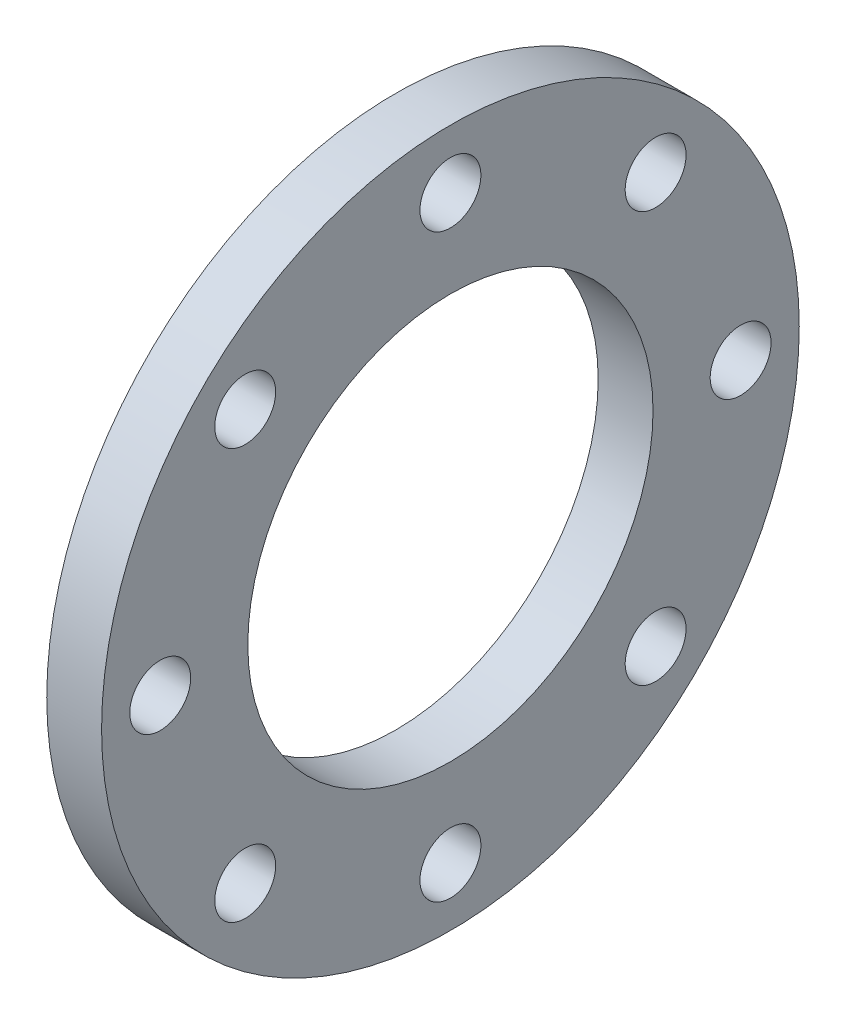
ISO-10303-21;
HEADER;
FILE_DESCRIPTION(('STEP AP214'),'2;1');
FILE_NAME('part.step','',(''),(''),'','','');
FILE_SCHEMA(('AUTOMOTIVE_DESIGN { 1 0 10303 214 1 1 1 1 }'));
ENDSEC;
DATA;
#1=APPLICATION_CONTEXT('core data for automotive mechanical design processes');
#2=APPLICATION_PROTOCOL_DEFINITION('international standard','automotive_design',2000,#1);
#3=PRODUCT_CONTEXT('',#1,'mechanical');
#4=PRODUCT('Part','Part','',(#3));
#5=PRODUCT_RELATED_PRODUCT_CATEGORY('part','',(#4));
#6=PRODUCT_DEFINITION_FORMATION('','',#4);
#7=PRODUCT_DEFINITION_CONTEXT('part definition',#1,'design');
#8=PRODUCT_DEFINITION('design','',#6,#7);
#9=PRODUCT_DEFINITION_SHAPE('','',#8);
#10=(LENGTH_UNIT() NAMED_UNIT(*) SI_UNIT(.MILLI.,.METRE.));
#11=(NAMED_UNIT(*) PLANE_ANGLE_UNIT() SI_UNIT($,.RADIAN.));
#12=(NAMED_UNIT(*) SI_UNIT($,.STERADIAN.) SOLID_ANGLE_UNIT());
#13=UNCERTAINTY_MEASURE_WITH_UNIT(LENGTH_MEASURE(1.E-05),#10,'distance_accuracy_value','');
#14=(GEOMETRIC_REPRESENTATION_CONTEXT(3) GLOBAL_UNCERTAINTY_ASSIGNED_CONTEXT((#13)) GLOBAL_UNIT_ASSIGNED_CONTEXT((#10,
#11,#12)) REPRESENTATION_CONTEXT('',''));
#15=CARTESIAN_POINT('',(0.,0.,0.));
#16=DIRECTION('',(0.,0.,1.));
#17=DIRECTION('',(1.,0.,0.));
#18=AXIS2_PLACEMENT_3D('',#15,#16,#17);
#19=CARTESIAN_POINT('',(18.,67.3519209080187,67.3519209080187));
#20=DIRECTION('',(-1.,0.,0.));
#21=DIRECTION('',(0.,0.,1.));
#22=AXIS2_PLACEMENT_3D('',#19,#20,#21);
#23=CYLINDRICAL_SURFACE('',#22,9.99999999999999);
#24=CARTESIAN_POINT('',(18.,67.3519209080187,67.3519209080187));
#25=DIRECTION('',(-1.,0.,0.));
#26=DIRECTION('',(0.,0.,1.));
#27=AXIS2_PLACEMENT_3D('',#24,#25,#26);
#28=CIRCLE('',#27,9.99999999999999);
#29=CARTESIAN_POINT('',(18.,67.3519209080187,77.3519209080187));
#30=VERTEX_POINT('',#29);
#31=EDGE_CURVE('E51',#30,#30,#28,.T.);
#32=ORIENTED_EDGE('',*,*,#31,.F.);
#33=EDGE_LOOP('',(#32));
#34=FACE_BOUND('',#33,.T.);
#35=CARTESIAN_POINT('',(0.,67.3519209080187,67.3519209080187));
#36=DIRECTION('',(-1.,0.,0.));
#37=DIRECTION('',(0.,0.,1.));
#38=AXIS2_PLACEMENT_3D('',#35,#36,#37);
#39=CIRCLE('',#38,9.99999999999999);
#40=CARTESIAN_POINT('',(0.,67.3519209080187,77.3519209080187));
#41=VERTEX_POINT('',#40);
#42=EDGE_CURVE('E16',#41,#41,#39,.F.);
#43=ORIENTED_EDGE('',*,*,#42,.F.);
#44=EDGE_LOOP('',(#43));
#45=FACE_BOUND('',#44,.T.);
#46=ADVANCED_FACE('F13',(#34,#45),#23,.F.);
#47=CARTESIAN_POINT('',(18.,0.,95.25));
#48=DIRECTION('',(-1.,0.,0.));
#49=DIRECTION('',(0.,0.,1.));
#50=AXIS2_PLACEMENT_3D('',#47,#48,#49);
#51=CYLINDRICAL_SURFACE('',#50,10.);
#52=CARTESIAN_POINT('',(18.,0.,95.25));
#53=DIRECTION('',(-1.,0.,0.));
#54=DIRECTION('',(0.,0.,1.));
#55=AXIS2_PLACEMENT_3D('',#52,#53,#54);
#56=CIRCLE('',#55,10.);
#57=CARTESIAN_POINT('',(18.,0.,105.25));
#58=VERTEX_POINT('',#57);
#59=EDGE_CURVE('E48',#58,#58,#56,.T.);
#60=ORIENTED_EDGE('',*,*,#59,.F.);
#61=EDGE_LOOP('',(#60));
#62=FACE_BOUND('',#61,.T.);
#63=CARTESIAN_POINT('',(0.,0.,95.25));
#64=DIRECTION('',(-1.,0.,0.));
#65=DIRECTION('',(0.,0.,1.));
#66=AXIS2_PLACEMENT_3D('',#63,#64,#65);
#67=CIRCLE('',#66,10.);
#68=CARTESIAN_POINT('',(0.,0.,105.25));
#69=VERTEX_POINT('',#68);
#70=EDGE_CURVE('E74',#69,#69,#67,.F.);
#71=ORIENTED_EDGE('',*,*,#70,.F.);
#72=EDGE_LOOP('',(#71));
#73=FACE_BOUND('',#72,.T.);
#74=ADVANCED_FACE('F85',(#62,#73),#51,.F.);
#75=CARTESIAN_POINT('',(18.,-67.3519209080186,67.3519209080187));
#76=DIRECTION('',(-1.,0.,0.));
#77=DIRECTION('',(0.,0.,1.));
#78=AXIS2_PLACEMENT_3D('',#75,#76,#77);
#79=CYLINDRICAL_SURFACE('',#78,10.);
#80=CARTESIAN_POINT('',(18.,-67.3519209080186,67.3519209080187));
#81=DIRECTION('',(-1.,0.,0.));
#82=DIRECTION('',(0.,0.,1.));
#83=AXIS2_PLACEMENT_3D('',#80,#81,#82);
#84=CIRCLE('',#83,10.);
#85=CARTESIAN_POINT('',(18.,-67.3519209080186,77.3519209080187));
#86=VERTEX_POINT('',#85);
#87=EDGE_CURVE('E45',#86,#86,#84,.T.);
#88=ORIENTED_EDGE('',*,*,#87,.F.);
#89=EDGE_LOOP('',(#88));
#90=FACE_BOUND('',#89,.T.);
#91=CARTESIAN_POINT('',(0.,-67.3519209080186,67.3519209080187));
#92=DIRECTION('',(-1.,0.,0.));
#93=DIRECTION('',(0.,0.,1.));
#94=AXIS2_PLACEMENT_3D('',#91,#92,#93);
#95=CIRCLE('',#94,10.);
#96=CARTESIAN_POINT('',(0.,-67.3519209080186,77.3519209080187));
#97=VERTEX_POINT('',#96);
#98=EDGE_CURVE('E72',#97,#97,#95,.F.);
#99=ORIENTED_EDGE('',*,*,#98,.F.);
#100=EDGE_LOOP('',(#99));
#101=FACE_BOUND('',#100,.T.);
#102=ADVANCED_FACE('F91',(#90,#101),#79,.F.);
#103=CARTESIAN_POINT('',(18.,-95.25,0.));
#104=DIRECTION('',(-1.,0.,0.));
#105=DIRECTION('',(0.,0.,1.));
#106=AXIS2_PLACEMENT_3D('',#103,#104,#105);
#107=CYLINDRICAL_SURFACE('',#106,9.99999999999999);
#108=CARTESIAN_POINT('',(18.,-95.25,0.));
#109=DIRECTION('',(-1.,0.,0.));
#110=DIRECTION('',(0.,0.,1.));
#111=AXIS2_PLACEMENT_3D('',#108,#109,#110);
#112=CIRCLE('',#111,9.99999999999999);
#113=CARTESIAN_POINT('',(18.,-95.25,10.));
#114=VERTEX_POINT('',#113);
#115=EDGE_CURVE('E42',#114,#114,#112,.T.);
#116=ORIENTED_EDGE('',*,*,#115,.F.);
#117=EDGE_LOOP('',(#116));
#118=FACE_BOUND('',#117,.T.);
#119=CARTESIAN_POINT('',(0.,-95.25,0.));
#120=DIRECTION('',(-1.,0.,0.));
#121=DIRECTION('',(0.,0.,1.));
#122=AXIS2_PLACEMENT_3D('',#119,#120,#121);
#123=CIRCLE('',#122,9.99999999999999);
#124=CARTESIAN_POINT('',(0.,-95.25,10.));
#125=VERTEX_POINT('',#124);
#126=EDGE_CURVE('E69',#125,#125,#123,.F.);
#127=ORIENTED_EDGE('',*,*,#126,.F.);
#128=EDGE_LOOP('',(#127));
#129=FACE_BOUND('',#128,.T.);
#130=ADVANCED_FACE('F127',(#118,#129),#107,.F.);
#131=CARTESIAN_POINT('',(18.,-67.3519209080187,-67.3519209080186));
#132=DIRECTION('',(-1.,0.,0.));
#133=DIRECTION('',(0.,0.,1.));
#134=AXIS2_PLACEMENT_3D('',#131,#132,#133);
#135=CYLINDRICAL_SURFACE('',#134,10.);
#136=CARTESIAN_POINT('',(18.,-67.3519209080187,-67.3519209080186));
#137=DIRECTION('',(-1.,0.,0.));
#138=DIRECTION('',(0.,0.,1.));
#139=AXIS2_PLACEMENT_3D('',#136,#137,#138);
#140=CIRCLE('',#139,10.);
#141=CARTESIAN_POINT('',(18.,-67.3519209080187,-57.3519209080186));
#142=VERTEX_POINT('',#141);
#143=EDGE_CURVE('E39',#142,#142,#140,.T.);
#144=ORIENTED_EDGE('',*,*,#143,.F.);
#145=EDGE_LOOP('',(#144));
#146=FACE_BOUND('',#145,.T.);
#147=CARTESIAN_POINT('',(0.,-67.3519209080187,-67.3519209080186));
#148=DIRECTION('',(-1.,0.,0.));
#149=DIRECTION('',(0.,0.,1.));
#150=AXIS2_PLACEMENT_3D('',#147,#148,#149);
#151=CIRCLE('',#150,10.);
#152=CARTESIAN_POINT('',(0.,-67.3519209080187,-57.3519209080186));
#153=VERTEX_POINT('',#152);
#154=EDGE_CURVE('E66',#153,#153,#151,.F.);
#155=ORIENTED_EDGE('',*,*,#154,.F.);
#156=EDGE_LOOP('',(#155));
#157=FACE_BOUND('',#156,.T.);
#158=ADVANCED_FACE('F123',(#146,#157),#135,.F.);
#159=CARTESIAN_POINT('',(18.,0.,-95.25));
#160=DIRECTION('',(-1.,0.,0.));
#161=DIRECTION('',(0.,0.,1.));
#162=AXIS2_PLACEMENT_3D('',#159,#160,#161);
#163=CYLINDRICAL_SURFACE('',#162,10.);
#164=CARTESIAN_POINT('',(18.,0.,-95.25));
#165=DIRECTION('',(-1.,0.,0.));
#166=DIRECTION('',(0.,0.,1.));
#167=AXIS2_PLACEMENT_3D('',#164,#165,#166);
#168=CIRCLE('',#167,10.);
#169=CARTESIAN_POINT('',(18.,0.,-85.25));
#170=VERTEX_POINT('',#169);
#171=EDGE_CURVE('E36',#170,#170,#168,.T.);
#172=ORIENTED_EDGE('',*,*,#171,.F.);
#173=EDGE_LOOP('',(#172));
#174=FACE_BOUND('',#173,.T.);
#175=CARTESIAN_POINT('',(0.,0.,-95.25));
#176=DIRECTION('',(-1.,0.,0.));
#177=DIRECTION('',(0.,0.,1.));
#178=AXIS2_PLACEMENT_3D('',#175,#176,#177);
#179=CIRCLE('',#178,10.);
#180=CARTESIAN_POINT('',(0.,0.,-85.25));
#181=VERTEX_POINT('',#180);
#182=EDGE_CURVE('E63',#181,#181,#179,.F.);
#183=ORIENTED_EDGE('',*,*,#182,.F.);
#184=EDGE_LOOP('',(#183));
#185=FACE_BOUND('',#184,.T.);
#186=ADVANCED_FACE('F119',(#174,#185),#163,.F.);
#187=CARTESIAN_POINT('',(18.,67.3519209080186,-67.3519209080187));
#188=DIRECTION('',(-1.,0.,0.));
#189=DIRECTION('',(0.,0.,1.));
#190=AXIS2_PLACEMENT_3D('',#187,#188,#189);
#191=CYLINDRICAL_SURFACE('',#190,9.99999999999999);
#192=CARTESIAN_POINT('',(18.,67.3519209080186,-67.3519209080187));
#193=DIRECTION('',(-1.,0.,0.));
#194=DIRECTION('',(0.,0.,1.));
#195=AXIS2_PLACEMENT_3D('',#192,#193,#194);
#196=CIRCLE('',#195,9.99999999999999);
#197=CARTESIAN_POINT('',(18.,67.3519209080186,-57.3519209080187));
#198=VERTEX_POINT('',#197);
#199=EDGE_CURVE('E33',#198,#198,#196,.T.);
#200=ORIENTED_EDGE('',*,*,#199,.F.);
#201=EDGE_LOOP('',(#200));
#202=FACE_BOUND('',#201,.T.);
#203=CARTESIAN_POINT('',(0.,67.3519209080186,-67.3519209080187));
#204=DIRECTION('',(-1.,0.,0.));
#205=DIRECTION('',(0.,0.,1.));
#206=AXIS2_PLACEMENT_3D('',#203,#204,#205);
#207=CIRCLE('',#206,9.99999999999999);
#208=CARTESIAN_POINT('',(0.,67.3519209080186,-57.3519209080187));
#209=VERTEX_POINT('',#208);
#210=EDGE_CURVE('E60',#209,#209,#207,.F.);
#211=ORIENTED_EDGE('',*,*,#210,.F.);
#212=EDGE_LOOP('',(#211));
#213=FACE_BOUND('',#212,.T.);
#214=ADVANCED_FACE('F115',(#202,#213),#191,.F.);
#215=CARTESIAN_POINT('',(18.,95.25,0.));
#216=DIRECTION('',(-1.,0.,0.));
#217=DIRECTION('',(0.,0.,1.));
#218=AXIS2_PLACEMENT_3D('',#215,#216,#217);
#219=CYLINDRICAL_SURFACE('',#218,9.99999999999999);
#220=CARTESIAN_POINT('',(18.,95.25,0.));
#221=DIRECTION('',(-1.,0.,0.));
#222=DIRECTION('',(0.,0.,1.));
#223=AXIS2_PLACEMENT_3D('',#220,#221,#222);
#224=CIRCLE('',#223,9.99999999999999);
#225=CARTESIAN_POINT('',(18.,95.25,9.99999999999999));
#226=VERTEX_POINT('',#225);
#227=EDGE_CURVE('E30',#226,#226,#224,.T.);
#228=ORIENTED_EDGE('',*,*,#227,.F.);
#229=EDGE_LOOP('',(#228));
#230=FACE_BOUND('',#229,.T.);
#231=CARTESIAN_POINT('',(0.,95.25,0.));
#232=DIRECTION('',(-1.,0.,0.));
#233=DIRECTION('',(0.,0.,1.));
#234=AXIS2_PLACEMENT_3D('',#231,#232,#233);
#235=CIRCLE('',#234,9.99999999999999);
#236=CARTESIAN_POINT('',(0.,95.25,9.99999999999999));
#237=VERTEX_POINT('',#236);
#238=EDGE_CURVE('E57',#237,#237,#235,.F.);
#239=ORIENTED_EDGE('',*,*,#238,.F.);
#240=EDGE_LOOP('',(#239));
#241=FACE_BOUND('',#240,.T.);
#242=ADVANCED_FACE('F111',(#230,#241),#219,.F.);
#243=CARTESIAN_POINT('',(0.,0.,0.));
#244=DIRECTION('',(1.,0.,0.));
#245=DIRECTION('',(0.,0.,-1.));
#246=AXIS2_PLACEMENT_3D('',#243,#244,#245);
#247=CYLINDRICAL_SURFACE('',#246,66.5);
#248=CARTESIAN_POINT('',(0.,0.,0.));
#249=DIRECTION('',(1.,0.,0.));
#250=DIRECTION('',(0.,0.,-1.));
#251=AXIS2_PLACEMENT_3D('',#248,#249,#250);
#252=CIRCLE('',#251,66.5);
#253=CARTESIAN_POINT('',(0.,0.,-66.5));
#254=VERTEX_POINT('',#253);
#255=EDGE_CURVE('E54',#254,#254,#252,.T.);
#256=ORIENTED_EDGE('',*,*,#255,.F.);
#257=EDGE_LOOP('',(#256));
#258=FACE_BOUND('',#257,.T.);
#259=CARTESIAN_POINT('',(18.,0.,0.));
#260=DIRECTION('',(1.,0.,0.));
#261=DIRECTION('',(0.,0.,-1.));
#262=AXIS2_PLACEMENT_3D('',#259,#260,#261);
#263=CIRCLE('',#262,66.5);
#264=CARTESIAN_POINT('',(18.,0.,-66.5));
#265=VERTEX_POINT('',#264);
#266=EDGE_CURVE('E25',#265,#265,#263,.F.);
#267=ORIENTED_EDGE('',*,*,#266,.F.);
#268=EDGE_LOOP('',(#267));
#269=FACE_BOUND('',#268,.T.);
#270=ADVANCED_FACE('F107',(#258,#269),#247,.F.);
#271=CARTESIAN_POINT('',(0.,-115.874004216595,-114.5));
#272=DIRECTION('',(-1.,0.,0.));
#273=DIRECTION('',(0.,0.,1.));
#274=AXIS2_PLACEMENT_3D('',#271,#272,#273);
#275=PLANE('',#274);
#276=ORIENTED_EDGE('',*,*,#255,.T.);
#277=EDGE_LOOP('',(#276));
#278=FACE_BOUND('',#277,.T.);
#279=ORIENTED_EDGE('',*,*,#238,.T.);
#280=EDGE_LOOP('',(#279));
#281=FACE_BOUND('',#280,.T.);
#282=ORIENTED_EDGE('',*,*,#210,.T.);
#283=EDGE_LOOP('',(#282));
#284=FACE_BOUND('',#283,.T.);
#285=ORIENTED_EDGE('',*,*,#182,.T.);
#286=EDGE_LOOP('',(#285));
#287=FACE_BOUND('',#286,.T.);
#288=ORIENTED_EDGE('',*,*,#154,.T.);
#289=EDGE_LOOP('',(#288));
#290=FACE_BOUND('',#289,.T.);
#291=ORIENTED_EDGE('',*,*,#126,.T.);
#292=EDGE_LOOP('',(#291));
#293=FACE_BOUND('',#292,.T.);
#294=ORIENTED_EDGE('',*,*,#98,.T.);
#295=EDGE_LOOP('',(#294));
#296=FACE_BOUND('',#295,.T.);
#297=ORIENTED_EDGE('',*,*,#70,.T.);
#298=EDGE_LOOP('',(#297));
#299=FACE_BOUND('',#298,.T.);
#300=ORIENTED_EDGE('',*,*,#42,.T.);
#301=EDGE_LOOP('',(#300));
#302=FACE_BOUND('',#301,.T.);
#303=CARTESIAN_POINT('',(0.,0.,0.));
#304=DIRECTION('',(1.,0.,0.));
#305=DIRECTION('',(0.,0.,-1.));
#306=AXIS2_PLACEMENT_3D('',#303,#304,#305);
#307=CIRCLE('',#306,114.5);
#308=CARTESIAN_POINT('',(0.,0.,-114.5));
#309=VERTEX_POINT('',#308);
#310=EDGE_CURVE('E20',#309,#309,#307,.T.);
#311=ORIENTED_EDGE('',*,*,#310,.F.);
#312=EDGE_LOOP('',(#311));
#313=FACE_BOUND('',#312,.T.);
#314=ADVANCED_FACE('F81',(#278,#281,#284,#287,#290,#293,#296,#299,#302,#313),#275,.T.);
#315=CARTESIAN_POINT('',(18.,-115.874004216595,114.5));
#316=DIRECTION('',(1.,0.,0.));
#317=DIRECTION('',(0.,0.,-1.));
#318=AXIS2_PLACEMENT_3D('',#315,#316,#317);
#319=PLANE('',#318);
#320=ORIENTED_EDGE('',*,*,#266,.T.);
#321=EDGE_LOOP('',(#320));
#322=FACE_BOUND('',#321,.T.);
#323=ORIENTED_EDGE('',*,*,#227,.T.);
#324=EDGE_LOOP('',(#323));
#325=FACE_BOUND('',#324,.T.);
#326=ORIENTED_EDGE('',*,*,#199,.T.);
#327=EDGE_LOOP('',(#326));
#328=FACE_BOUND('',#327,.T.);
#329=ORIENTED_EDGE('',*,*,#171,.T.);
#330=EDGE_LOOP('',(#329));
#331=FACE_BOUND('',#330,.T.);
#332=ORIENTED_EDGE('',*,*,#143,.T.);
#333=EDGE_LOOP('',(#332));
#334=FACE_BOUND('',#333,.T.);
#335=ORIENTED_EDGE('',*,*,#115,.T.);
#336=EDGE_LOOP('',(#335));
#337=FACE_BOUND('',#336,.T.);
#338=ORIENTED_EDGE('',*,*,#87,.T.);
#339=EDGE_LOOP('',(#338));
#340=FACE_BOUND('',#339,.T.);
#341=ORIENTED_EDGE('',*,*,#59,.T.);
#342=EDGE_LOOP('',(#341));
#343=FACE_BOUND('',#342,.T.);
#344=ORIENTED_EDGE('',*,*,#31,.T.);
#345=EDGE_LOOP('',(#344));
#346=FACE_BOUND('',#345,.T.);
#347=CARTESIAN_POINT('',(18.,0.,0.));
#348=DIRECTION('',(1.,0.,0.));
#349=DIRECTION('',(0.,0.,-1.));
#350=AXIS2_PLACEMENT_3D('',#347,#348,#349);
#351=CIRCLE('',#350,114.5);
#352=CARTESIAN_POINT('',(18.,0.,-114.5));
#353=VERTEX_POINT('',#352);
#354=EDGE_CURVE('E8',#353,#353,#351,.F.);
#355=ORIENTED_EDGE('',*,*,#354,.F.);
#356=EDGE_LOOP('',(#355));
#357=FACE_BOUND('',#356,.T.);
#358=ADVANCED_FACE('F96',(#322,#325,#328,#331,#334,#337,#340,#343,#346,#357),#319,.T.);
#359=CARTESIAN_POINT('',(18.,0.,0.));
#360=DIRECTION('',(1.,0.,0.));
#361=DIRECTION('',(0.,0.,-1.));
#362=AXIS2_PLACEMENT_3D('',#359,#360,#361);
#363=CYLINDRICAL_SURFACE('',#362,114.5);
#364=ORIENTED_EDGE('',*,*,#310,.T.);
#365=EDGE_LOOP('',(#364));
#366=FACE_BOUND('',#365,.T.);
#367=ORIENTED_EDGE('',*,*,#354,.T.);
#368=EDGE_LOOP('',(#367));
#369=FACE_BOUND('',#368,.T.);
#370=ADVANCED_FACE('F94',(#366,#369),#363,.T.);
#371=CLOSED_SHELL('',(#46,#74,#102,#130,#158,#186,#214,#242,#270,#314,#358,#370));
#372=MANIFOLD_SOLID_BREP('B1',#371);
#373=ADVANCED_BREP_SHAPE_REPRESENTATION('',(#18,#372),#14);
#374=SHAPE_DEFINITION_REPRESENTATION(#9,#373);
ENDSEC;
END-ISO-10303-21;
